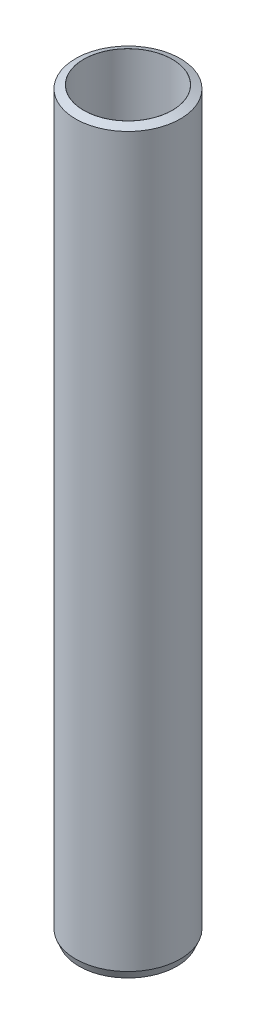
ISO-10303-21;
HEADER;
FILE_DESCRIPTION(('STEP AP214'),'2;1');
FILE_NAME('part.step','',(''),(''),'','','');
FILE_SCHEMA(('AUTOMOTIVE_DESIGN { 1 0 10303 214 1 1 1 1 }'));
ENDSEC;
DATA;
#1=APPLICATION_CONTEXT('core data for automotive mechanical design processes');
#2=APPLICATION_PROTOCOL_DEFINITION('international standard','automotive_design',2000,#1);
#3=PRODUCT_CONTEXT('',#1,'mechanical');
#4=PRODUCT('Part','Part','',(#3));
#5=PRODUCT_RELATED_PRODUCT_CATEGORY('part','',(#4));
#6=PRODUCT_DEFINITION_FORMATION('','',#4);
#7=PRODUCT_DEFINITION_CONTEXT('part definition',#1,'design');
#8=PRODUCT_DEFINITION('design','',#6,#7);
#9=PRODUCT_DEFINITION_SHAPE('','',#8);
#10=(LENGTH_UNIT() NAMED_UNIT(*) SI_UNIT(.MILLI.,.METRE.));
#11=(NAMED_UNIT(*) PLANE_ANGLE_UNIT() SI_UNIT($,.RADIAN.));
#12=(NAMED_UNIT(*) SI_UNIT($,.STERADIAN.) SOLID_ANGLE_UNIT());
#13=UNCERTAINTY_MEASURE_WITH_UNIT(LENGTH_MEASURE(1.E-05),#10,'distance_accuracy_value','');
#14=(GEOMETRIC_REPRESENTATION_CONTEXT(3) GLOBAL_UNCERTAINTY_ASSIGNED_CONTEXT((#13)) GLOBAL_UNIT_ASSIGNED_CONTEXT((#10,
#11,#12)) REPRESENTATION_CONTEXT('',''));
#15=CARTESIAN_POINT('',(0.,0.,0.));
#16=DIRECTION('',(0.,0.,1.));
#17=DIRECTION('',(1.,0.,0.));
#18=AXIS2_PLACEMENT_3D('',#15,#16,#17);
#19=CARTESIAN_POINT('',(0.,600.,0.));
#20=DIRECTION('',(0.,-1.,0.));
#21=DIRECTION('',(0.,0.,-1.));
#22=AXIS2_PLACEMENT_3D('',#19,#20,#21);
#23=CYLINDRICAL_SURFACE('',#22,42.5);
#24=CARTESIAN_POINT('',(0.,597.236136749598,0.));
#25=DIRECTION('',(0.,1.,0.));
#26=DIRECTION('',(0.,0.,1.));
#27=AXIS2_PLACEMENT_3D('',#24,#25,#26);
#28=CIRCLE('',#27,42.5);
#29=CARTESIAN_POINT('',(0.,597.236136749598,42.5));
#30=VERTEX_POINT('',#29);
#31=EDGE_CURVE('E50',#30,#30,#28,.F.);
#32=ORIENTED_EDGE('',*,*,#31,.T.);
#33=EDGE_LOOP('',(#32));
#34=FACE_BOUND('',#33,.T.);
#35=CARTESIAN_POINT('',(0.,6.50856064705596,0.));
#36=DIRECTION('',(0.,1.,0.));
#37=DIRECTION('',(0.,0.,1.));
#38=AXIS2_PLACEMENT_3D('',#35,#36,#37);
#39=CIRCLE('',#38,42.5);
#40=CARTESIAN_POINT('',(0.,6.50856064705596,42.5));
#41=VERTEX_POINT('',#40);
#42=EDGE_CURVE('E51',#41,#41,#39,.T.);
#43=ORIENTED_EDGE('',*,*,#42,.T.);
#44=EDGE_LOOP('',(#43));
#45=FACE_BOUND('',#44,.T.);
#46=ADVANCED_FACE('F39',(#34,#45),#23,.T.);
#47=CARTESIAN_POINT('',(0.,600.,0.));
#48=DIRECTION('',(0.,1.,0.));
#49=DIRECTION('',(0.,0.,1.));
#50=AXIS2_PLACEMENT_3D('',#47,#48,#49);
#51=PLANE('',#50);
#52=CARTESIAN_POINT('',(0.,600.,0.));
#53=DIRECTION('',(0.,1.,0.));
#54=DIRECTION('',(0.,0.,1.));
#55=AXIS2_PLACEMENT_3D('',#52,#53,#54);
#56=CIRCLE('',#55,35.9914393529445);
#57=CARTESIAN_POINT('',(0.,600.,35.9914393529445));
#58=VERTEX_POINT('',#57);
#59=EDGE_CURVE('E54',#58,#58,#56,.T.);
#60=ORIENTED_EDGE('',*,*,#59,.T.);
#61=EDGE_LOOP('',(#60));
#62=FACE_BOUND('',#61,.T.);
#63=CARTESIAN_POINT('',(0.,600.,0.));
#64=DIRECTION('',(0.,1.,0.));
#65=DIRECTION('',(0.,0.,1.));
#66=AXIS2_PLACEMENT_3D('',#63,#64,#65);
#67=CIRCLE('',#66,35.9271553868163);
#68=CARTESIAN_POINT('',(0.,600.,35.9271553868163));
#69=VERTEX_POINT('',#68);
#70=EDGE_CURVE('E58',#69,#69,#67,.T.);
#71=ORIENTED_EDGE('',*,*,#70,.F.);
#72=EDGE_LOOP('',(#71));
#73=FACE_BOUND('',#72,.T.);
#74=ADVANCED_FACE('F69',(#62,#73),#51,.T.);
#75=CARTESIAN_POINT('',(0.,0.,0.));
#76=DIRECTION('',(0.,1.,0.));
#77=DIRECTION('',(0.,0.,1.));
#78=AXIS2_PLACEMENT_3D('',#75,#76,#77);
#79=PLANE('',#78);
#80=CARTESIAN_POINT('',(0.,0.,0.));
#81=DIRECTION('',(0.,1.,0.));
#82=DIRECTION('',(0.,0.,1.));
#83=AXIS2_PLACEMENT_3D('',#80,#81,#82);
#84=CIRCLE('',#83,39.7361367495974);
#85=CARTESIAN_POINT('',(0.,0.,39.7361367495974));
#86=VERTEX_POINT('',#85);
#87=EDGE_CURVE('E10',#86,#86,#84,.F.);
#88=ORIENTED_EDGE('',*,*,#87,.T.);
#89=EDGE_LOOP('',(#88));
#90=FACE_BOUND('',#89,.T.);
#91=CARTESIAN_POINT('',(0.,0.,0.));
#92=DIRECTION('',(0.,1.,0.));
#93=DIRECTION('',(0.,0.,1.));
#94=AXIS2_PLACEMENT_3D('',#91,#92,#93);
#95=CIRCLE('',#94,35.9271553868163);
#96=CARTESIAN_POINT('',(0.,0.,35.9271553868163));
#97=VERTEX_POINT('',#96);
#98=EDGE_CURVE('E63',#97,#97,#95,.T.);
#99=ORIENTED_EDGE('',*,*,#98,.T.);
#100=EDGE_LOOP('',(#99));
#101=FACE_BOUND('',#100,.T.);
#102=ADVANCED_FACE('F75',(#90,#101),#79,.F.);
#103=CARTESIAN_POINT('',(0.,600.,0.));
#104=DIRECTION('',(0.,-1.,0.));
#105=DIRECTION('',(0.,0.,-1.));
#106=AXIS2_PLACEMENT_3D('',#103,#104,#105);
#107=CYLINDRICAL_SURFACE('',#106,35.9271553868163);
#108=ORIENTED_EDGE('',*,*,#70,.T.);
#109=EDGE_LOOP('',(#108));
#110=FACE_BOUND('',#109,.T.);
#111=ORIENTED_EDGE('',*,*,#98,.F.);
#112=EDGE_LOOP('',(#111));
#113=FACE_BOUND('',#112,.T.);
#114=ADVANCED_FACE('F70',(#110,#113),#107,.F.);
#115=CARTESIAN_POINT('',(0.,600.,0.));
#116=DIRECTION('',(0.,-1.,0.));
#117=DIRECTION('',(0.,0.,-1.));
#118=AXIS2_PLACEMENT_3D('',#115,#116,#117);
#119=CONICAL_SURFACE('',#118,35.9914393529445,1.16922178303272);
#120=ORIENTED_EDGE('',*,*,#31,.F.);
#121=EDGE_LOOP('',(#120));
#122=FACE_BOUND('',#121,.T.);
#123=ORIENTED_EDGE('',*,*,#59,.F.);
#124=EDGE_LOOP('',(#123));
#125=FACE_BOUND('',#124,.T.);
#126=ADVANCED_FACE('F81',(#122,#125),#119,.T.);
#127=CARTESIAN_POINT('',(0.,6.50856064705596,0.));
#128=DIRECTION('',(0.,1.,0.));
#129=DIRECTION('',(0.,0.,1.));
#130=AXIS2_PLACEMENT_3D('',#127,#128,#129);
#131=CONICAL_SURFACE('',#130,42.5,0.40157454376217);
#132=ORIENTED_EDGE('',*,*,#87,.F.);
#133=EDGE_LOOP('',(#132));
#134=FACE_BOUND('',#133,.T.);
#135=ORIENTED_EDGE('',*,*,#42,.F.);
#136=EDGE_LOOP('',(#135));
#137=FACE_BOUND('',#136,.T.);
#138=ADVANCED_FACE('F45',(#134,#137),#131,.T.);
#139=CLOSED_SHELL('',(#46,#74,#102,#114,#126,#138));
#140=MANIFOLD_SOLID_BREP('B2',#139);
#141=ADVANCED_BREP_SHAPE_REPRESENTATION('',(#18,#140),#14);
#142=SHAPE_DEFINITION_REPRESENTATION(#9,#141);
ENDSEC;
END-ISO-10303-21;
